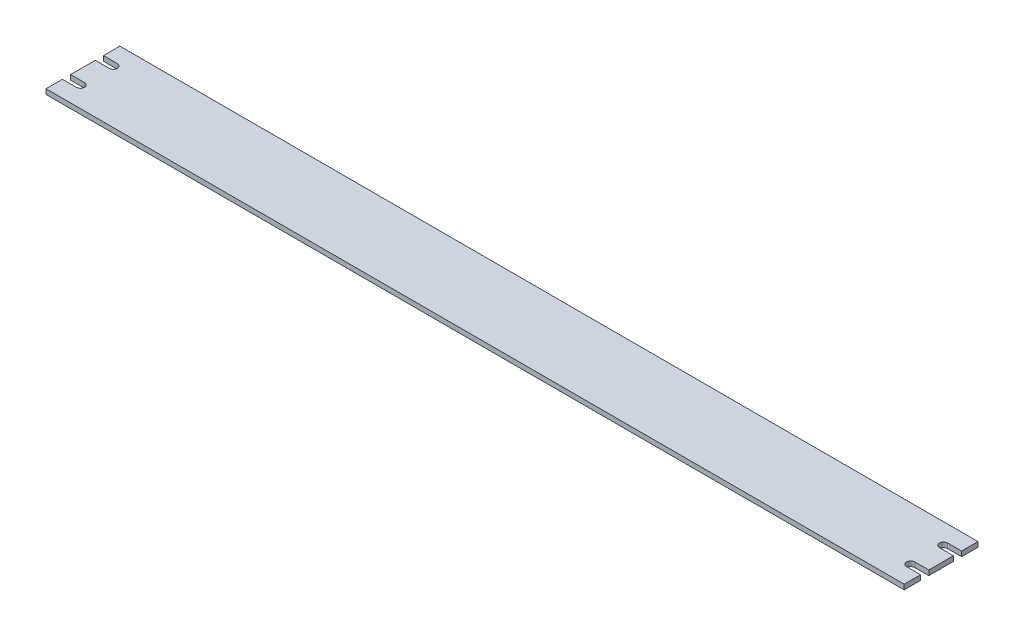
ISO-10303-21;
HEADER;
FILE_DESCRIPTION(('STEP AP214'),'2;1');
FILE_NAME('part.step','',(''),(''),'','','');
FILE_SCHEMA(('AUTOMOTIVE_DESIGN { 1 0 10303 214 1 1 1 1 }'));
ENDSEC;
DATA;
#1=APPLICATION_CONTEXT('core data for automotive mechanical design processes');
#2=APPLICATION_PROTOCOL_DEFINITION('international standard','automotive_design',2000,#1);
#3=PRODUCT_CONTEXT('',#1,'mechanical');
#4=PRODUCT('Part','Part','',(#3));
#5=PRODUCT_RELATED_PRODUCT_CATEGORY('part','',(#4));
#6=PRODUCT_DEFINITION_FORMATION('','',#4);
#7=PRODUCT_DEFINITION_CONTEXT('part definition',#1,'design');
#8=PRODUCT_DEFINITION('design','',#6,#7);
#9=PRODUCT_DEFINITION_SHAPE('','',#8);
#10=(LENGTH_UNIT() NAMED_UNIT(*) SI_UNIT(.MILLI.,.METRE.));
#11=(NAMED_UNIT(*) PLANE_ANGLE_UNIT() SI_UNIT($,.RADIAN.));
#12=(NAMED_UNIT(*) SI_UNIT($,.STERADIAN.) SOLID_ANGLE_UNIT());
#13=UNCERTAINTY_MEASURE_WITH_UNIT(LENGTH_MEASURE(1.E-05),#10,'distance_accuracy_value','');
#14=(GEOMETRIC_REPRESENTATION_CONTEXT(3) GLOBAL_UNCERTAINTY_ASSIGNED_CONTEXT((#13)) GLOBAL_UNIT_ASSIGNED_CONTEXT((#10,
#11,#12)) REPRESENTATION_CONTEXT('',''));
#15=CARTESIAN_POINT('',(0.,0.,0.));
#16=DIRECTION('',(0.,0.,1.));
#17=DIRECTION('',(1.,0.,0.));
#18=AXIS2_PLACEMENT_3D('',#15,#16,#17);
#19=CARTESIAN_POINT('',(261.5,3.,22.5));
#20=DIRECTION('',(-1.,0.,0.));
#21=DIRECTION('',(0.,0.,1.));
#22=AXIS2_PLACEMENT_3D('',#19,#20,#21);
#23=PLANE('',#22);
#24=DIRECTION('',(0.,0.,-1.));
#25=VECTOR('',#24,1.);
#26=CARTESIAN_POINT('',(261.5,0.,22.5));
#27=LINE('',#26,#25);
#28=CARTESIAN_POINT('',(261.5,0.,22.5));
#29=VERTEX_POINT('',#28);
#30=CARTESIAN_POINT('',(261.5,0.,12.5));
#31=VERTEX_POINT('',#30);
#32=EDGE_CURVE('E193',#29,#31,#27,.T.);
#33=ORIENTED_EDGE('',*,*,#32,.T.);
#34=DIRECTION('',(0.,1.,0.));
#35=VECTOR('',#34,1.);
#36=CARTESIAN_POINT('',(261.5,0.,12.5));
#37=LINE('',#36,#35);
#38=CARTESIAN_POINT('',(261.5,3.,12.5));
#39=VERTEX_POINT('',#38);
#40=EDGE_CURVE('E234',#31,#39,#37,.T.);
#41=ORIENTED_EDGE('',*,*,#40,.T.);
#42=DIRECTION('',(0.,0.,-1.));
#43=VECTOR('',#42,1.);
#44=CARTESIAN_POINT('',(261.5,3.,22.5));
#45=LINE('',#44,#43);
#46=CARTESIAN_POINT('',(261.5,3.,22.5));
#47=VERTEX_POINT('',#46);
#48=EDGE_CURVE('E217',#47,#39,#45,.T.);
#49=ORIENTED_EDGE('',*,*,#48,.F.);
#50=DIRECTION('',(0.,-1.,0.));
#51=VECTOR('',#50,1.);
#52=CARTESIAN_POINT('',(261.5,3.,22.5));
#53=LINE('',#52,#51);
#54=EDGE_CURVE('E41',#47,#29,#53,.T.);
#55=ORIENTED_EDGE('',*,*,#54,.T.);
#56=EDGE_LOOP('',(#33,#41,#49,#55));
#57=FACE_BOUND('',#56,.T.);
#58=ADVANCED_FACE('F33',(#57),#23,.F.);
#59=CARTESIAN_POINT('',(261.5,3.,7.5000000000001));
#60=VERTEX_POINT('',#59);
#61=CARTESIAN_POINT('',(261.5,3.,-7.5000000000001));
#62=VERTEX_POINT('',#61);
#63=EDGE_CURVE('E186',#60,#62,#45,.T.);
#64=ORIENTED_EDGE('',*,*,#63,.F.);
#65=DIRECTION('',(0.,1.,0.));
#66=VECTOR('',#65,1.);
#67=CARTESIAN_POINT('',(261.5,0.,7.5000000000001));
#68=LINE('',#67,#66);
#69=CARTESIAN_POINT('',(261.5,0.,7.5000000000001));
#70=VERTEX_POINT('',#69);
#71=EDGE_CURVE('E173',#70,#60,#68,.T.);
#72=ORIENTED_EDGE('',*,*,#71,.F.);
#73=CARTESIAN_POINT('',(261.5,0.,-7.5000000000001));
#74=VERTEX_POINT('',#73);
#75=EDGE_CURVE('E184',#70,#74,#27,.T.);
#76=ORIENTED_EDGE('',*,*,#75,.T.);
#77=DIRECTION('',(0.,1.,0.));
#78=VECTOR('',#77,1.);
#79=CARTESIAN_POINT('',(261.5,0.,-7.5000000000001));
#80=LINE('',#79,#78);
#81=EDGE_CURVE('E254',#74,#62,#80,.T.);
#82=ORIENTED_EDGE('',*,*,#81,.T.);
#83=EDGE_LOOP('',(#64,#72,#76,#82));
#84=FACE_BOUND('',#83,.T.);
#85=ADVANCED_FACE('F182',(#84),#23,.F.);
#86=CARTESIAN_POINT('',(-261.5,3.,22.5));
#87=DIRECTION('',(1.,0.,0.));
#88=DIRECTION('',(0.,0.,-1.));
#89=AXIS2_PLACEMENT_3D('',#86,#87,#88);
#90=PLANE('',#89);
#91=DIRECTION('',(0.,0.,1.));
#92=VECTOR('',#91,1.);
#93=CARTESIAN_POINT('',(-261.5,0.,22.5));
#94=LINE('',#93,#92);
#95=CARTESIAN_POINT('',(-261.5,0.,-7.5000000000001));
#96=VERTEX_POINT('',#95);
#97=CARTESIAN_POINT('',(-261.5,0.,7.5000000000001));
#98=VERTEX_POINT('',#97);
#99=EDGE_CURVE('E324',#96,#98,#94,.T.);
#100=ORIENTED_EDGE('',*,*,#99,.T.);
#101=DIRECTION('',(0.,1.,0.));
#102=VECTOR('',#101,1.);
#103=CARTESIAN_POINT('',(-261.5,0.,7.5000000000001));
#104=LINE('',#103,#102);
#105=CARTESIAN_POINT('',(-261.5,3.,7.5000000000001));
#106=VERTEX_POINT('',#105);
#107=EDGE_CURVE('E279',#98,#106,#104,.T.);
#108=ORIENTED_EDGE('',*,*,#107,.T.);
#109=DIRECTION('',(0.,0.,1.));
#110=VECTOR('',#109,1.);
#111=CARTESIAN_POINT('',(-261.5,3.,22.5));
#112=LINE('',#111,#110);
#113=CARTESIAN_POINT('',(-261.5,3.,-7.5000000000001));
#114=VERTEX_POINT('',#113);
#115=EDGE_CURVE('E318',#114,#106,#112,.T.);
#116=ORIENTED_EDGE('',*,*,#115,.F.);
#117=DIRECTION('',(0.,1.,0.));
#118=VECTOR('',#117,1.);
#119=CARTESIAN_POINT('',(-261.5,0.,-7.5000000000001));
#120=LINE('',#119,#118);
#121=EDGE_CURVE('E298',#96,#114,#120,.T.);
#122=ORIENTED_EDGE('',*,*,#121,.F.);
#123=EDGE_LOOP('',(#100,#108,#116,#122));
#124=FACE_BOUND('',#123,.T.);
#125=ADVANCED_FACE('F346',(#124),#90,.F.);
#126=CARTESIAN_POINT('',(-261.5,0.,-22.5));
#127=VERTEX_POINT('',#126);
#128=CARTESIAN_POINT('',(-261.5,0.,-12.5000000000001));
#129=VERTEX_POINT('',#128);
#130=EDGE_CURVE('E322',#127,#129,#94,.T.);
#131=ORIENTED_EDGE('',*,*,#130,.T.);
#132=DIRECTION('',(0.,1.,0.));
#133=VECTOR('',#132,1.);
#134=CARTESIAN_POINT('',(-261.5,0.,-12.5000000000001));
#135=LINE('',#134,#133);
#136=CARTESIAN_POINT('',(-261.5,3.,-12.5000000000001));
#137=VERTEX_POINT('',#136);
#138=EDGE_CURVE('E305',#129,#137,#135,.T.);
#139=ORIENTED_EDGE('',*,*,#138,.T.);
#140=CARTESIAN_POINT('',(-261.5,3.,-22.5));
#141=VERTEX_POINT('',#140);
#142=EDGE_CURVE('E314',#141,#137,#112,.T.);
#143=ORIENTED_EDGE('',*,*,#142,.F.);
#144=DIRECTION('',(0.,-1.,0.));
#145=VECTOR('',#144,1.);
#146=CARTESIAN_POINT('',(-261.5,3.,-22.5));
#147=LINE('',#146,#145);
#148=EDGE_CURVE('E204',#141,#127,#147,.T.);
#149=ORIENTED_EDGE('',*,*,#148,.T.);
#150=EDGE_LOOP('',(#131,#139,#143,#149));
#151=FACE_BOUND('',#150,.T.);
#152=ADVANCED_FACE('F365',(#151),#90,.F.);
#153=CARTESIAN_POINT('',(-261.5,3.,12.5));
#154=VERTEX_POINT('',#153);
#155=CARTESIAN_POINT('',(-261.5,3.,22.5));
#156=VERTEX_POINT('',#155);
#157=EDGE_CURVE('E203',#154,#156,#112,.T.);
#158=ORIENTED_EDGE('',*,*,#157,.F.);
#159=DIRECTION('',(0.,1.,0.));
#160=VECTOR('',#159,1.);
#161=CARTESIAN_POINT('',(-261.5,0.,12.5));
#162=LINE('',#161,#160);
#163=CARTESIAN_POINT('',(-261.5,0.,12.5));
#164=VERTEX_POINT('',#163);
#165=EDGE_CURVE('E272',#164,#154,#162,.T.);
#166=ORIENTED_EDGE('',*,*,#165,.F.);
#167=CARTESIAN_POINT('',(-261.5,0.,22.5));
#168=VERTEX_POINT('',#167);
#169=EDGE_CURVE('E308',#164,#168,#94,.T.);
#170=ORIENTED_EDGE('',*,*,#169,.T.);
#171=DIRECTION('',(0.,-1.,0.));
#172=VECTOR('',#171,1.);
#173=CARTESIAN_POINT('',(-261.5,3.,22.5));
#174=LINE('',#173,#172);
#175=EDGE_CURVE('E11',#156,#168,#174,.T.);
#176=ORIENTED_EDGE('',*,*,#175,.F.);
#177=EDGE_LOOP('',(#158,#166,#170,#176));
#178=FACE_BOUND('',#177,.T.);
#179=ADVANCED_FACE('F35',(#178),#90,.F.);
#180=CARTESIAN_POINT('',(261.5,3.,22.5));
#181=DIRECTION('',(0.,0.,-1.));
#182=DIRECTION('',(-1.,0.,0.));
#183=AXIS2_PLACEMENT_3D('',#180,#181,#182);
#184=PLANE('',#183);
#185=DIRECTION('',(1.,0.,0.));
#186=VECTOR('',#185,1.);
#187=CARTESIAN_POINT('',(261.5,0.,22.5));
#188=LINE('',#187,#186);
#189=EDGE_CURVE('E198',#168,#29,#188,.T.);
#190=ORIENTED_EDGE('',*,*,#189,.T.);
#191=ORIENTED_EDGE('',*,*,#54,.F.);
#192=DIRECTION('',(1.,0.,0.));
#193=VECTOR('',#192,1.);
#194=CARTESIAN_POINT('',(261.5,3.,22.5));
#195=LINE('',#194,#193);
#196=EDGE_CURVE('E317',#156,#47,#195,.T.);
#197=ORIENTED_EDGE('',*,*,#196,.F.);
#198=ORIENTED_EDGE('',*,*,#175,.T.);
#199=EDGE_LOOP('',(#190,#191,#197,#198));
#200=FACE_BOUND('',#199,.T.);
#201=ADVANCED_FACE('F400',(#200),#184,.F.);
#202=CARTESIAN_POINT('',(261.5,3.,-12.5000000000001));
#203=VERTEX_POINT('',#202);
#204=CARTESIAN_POINT('',(261.5,3.,-22.5));
#205=VERTEX_POINT('',#204);
#206=EDGE_CURVE('E320',#203,#205,#45,.T.);
#207=ORIENTED_EDGE('',*,*,#206,.F.);
#208=DIRECTION('',(0.,1.,0.));
#209=VECTOR('',#208,1.);
#210=CARTESIAN_POINT('',(261.5,0.,-12.5000000000001));
#211=LINE('',#210,#209);
#212=CARTESIAN_POINT('',(261.5,0.,-12.5000000000001));
#213=VERTEX_POINT('',#212);
#214=EDGE_CURVE('E246',#213,#203,#211,.T.);
#215=ORIENTED_EDGE('',*,*,#214,.F.);
#216=CARTESIAN_POINT('',(261.5,0.,-22.5));
#217=VERTEX_POINT('',#216);
#218=EDGE_CURVE('E194',#213,#217,#27,.T.);
#219=ORIENTED_EDGE('',*,*,#218,.T.);
#220=DIRECTION('',(0.,-1.,0.));
#221=VECTOR('',#220,1.);
#222=CARTESIAN_POINT('',(261.5,3.,-22.5));
#223=LINE('',#222,#221);
#224=EDGE_CURVE('E207',#205,#217,#223,.T.);
#225=ORIENTED_EDGE('',*,*,#224,.F.);
#226=EDGE_LOOP('',(#207,#215,#219,#225));
#227=FACE_BOUND('',#226,.T.);
#228=ADVANCED_FACE('F376',(#227),#23,.F.);
#229=CARTESIAN_POINT('',(261.5,3.,-22.5));
#230=DIRECTION('',(0.,0.,1.));
#231=DIRECTION('',(1.,0.,0.));
#232=AXIS2_PLACEMENT_3D('',#229,#230,#231);
#233=PLANE('',#232);
#234=DIRECTION('',(-1.,0.,0.));
#235=VECTOR('',#234,1.);
#236=CARTESIAN_POINT('',(261.5,0.,-22.5));
#237=LINE('',#236,#235);
#238=EDGE_CURVE('E197',#217,#127,#237,.T.);
#239=ORIENTED_EDGE('',*,*,#238,.T.);
#240=ORIENTED_EDGE('',*,*,#148,.F.);
#241=DIRECTION('',(-1.,0.,0.));
#242=VECTOR('',#241,1.);
#243=CARTESIAN_POINT('',(261.5,3.,-22.5));
#244=LINE('',#243,#242);
#245=EDGE_CURVE('E208',#205,#141,#244,.T.);
#246=ORIENTED_EDGE('',*,*,#245,.F.);
#247=ORIENTED_EDGE('',*,*,#224,.T.);
#248=EDGE_LOOP('',(#239,#240,#246,#247));
#249=FACE_BOUND('',#248,.T.);
#250=ADVANCED_FACE('F372',(#249),#233,.F.);
#251=CARTESIAN_POINT('',(0.,3.,0.));
#252=DIRECTION('',(0.,1.,0.));
#253=DIRECTION('',(0.,0.,1.));
#254=AXIS2_PLACEMENT_3D('',#251,#252,#253);
#255=PLANE('',#254);
#256=DIRECTION('',(1.,0.,0.));
#257=VECTOR('',#256,1.);
#258=CARTESIAN_POINT('',(261.5,3.,12.5));
#259=LINE('',#258,#257);
#260=CARTESIAN_POINT('',(253.,3.,12.5));
#261=VERTEX_POINT('',#260);
#262=EDGE_CURVE('E178',#261,#39,#259,.T.);
#263=ORIENTED_EDGE('',*,*,#262,.F.);
#264=CARTESIAN_POINT('',(253.,3.,9.99999999999991));
#265=DIRECTION('',(0.,1.,0.));
#266=DIRECTION('',(0.,0.,1.));
#267=AXIS2_PLACEMENT_3D('',#264,#265,#266);
#268=CIRCLE('',#267,2.49999999999994);
#269=CARTESIAN_POINT('',(253.,3.,7.49999999999997));
#270=VERTEX_POINT('',#269);
#271=EDGE_CURVE('E230',#270,#261,#268,.T.);
#272=ORIENTED_EDGE('',*,*,#271,.F.);
#273=DIRECTION('',(-1.,0.,0.));
#274=VECTOR('',#273,1.);
#275=CARTESIAN_POINT('',(261.5,3.,7.5000000000001));
#276=LINE('',#275,#274);
#277=EDGE_CURVE('E228',#60,#270,#276,.T.);
#278=ORIENTED_EDGE('',*,*,#277,.F.);
#279=ORIENTED_EDGE('',*,*,#63,.T.);
#280=DIRECTION('',(1.,0.,0.));
#281=VECTOR('',#280,1.);
#282=CARTESIAN_POINT('',(261.5,3.,-7.5000000000001));
#283=LINE('',#282,#281);
#284=CARTESIAN_POINT('',(253.,3.,-7.50000000000004));
#285=VERTEX_POINT('',#284);
#286=EDGE_CURVE('E243',#285,#62,#283,.T.);
#287=ORIENTED_EDGE('',*,*,#286,.F.);
#288=CARTESIAN_POINT('',(253.,3.,-10.));
#289=DIRECTION('',(0.,1.,0.));
#290=DIRECTION('',(0.,0.,-1.));
#291=AXIS2_PLACEMENT_3D('',#288,#289,#290);
#292=CIRCLE('',#291,2.5);
#293=CARTESIAN_POINT('',(253.,3.,-12.5000000000001));
#294=VERTEX_POINT('',#293);
#295=EDGE_CURVE('E249',#294,#285,#292,.T.);
#296=ORIENTED_EDGE('',*,*,#295,.F.);
#297=DIRECTION('',(-1.,0.,0.));
#298=VECTOR('',#297,1.);
#299=CARTESIAN_POINT('',(261.5,3.,-12.5000000000001));
#300=LINE('',#299,#298);
#301=EDGE_CURVE('E236',#203,#294,#300,.T.);
#302=ORIENTED_EDGE('',*,*,#301,.F.);
#303=ORIENTED_EDGE('',*,*,#206,.T.);
#304=ORIENTED_EDGE('',*,*,#245,.T.);
#305=ORIENTED_EDGE('',*,*,#142,.T.);
#306=DIRECTION('',(-1.,0.,0.));
#307=VECTOR('',#306,1.);
#308=CARTESIAN_POINT('',(-261.5,3.,-12.5000000000001));
#309=LINE('',#308,#307);
#310=CARTESIAN_POINT('',(-253.,3.,-12.5000000000001));
#311=VERTEX_POINT('',#310);
#312=EDGE_CURVE('E292',#311,#137,#309,.T.);
#313=ORIENTED_EDGE('',*,*,#312,.F.);
#314=CARTESIAN_POINT('',(-253.,3.,-10.));
#315=DIRECTION('',(0.,1.,0.));
#316=DIRECTION('',(0.,0.,1.));
#317=AXIS2_PLACEMENT_3D('',#314,#315,#316);
#318=CIRCLE('',#317,2.5);
#319=CARTESIAN_POINT('',(-253.,3.,-7.50000000000004));
#320=VERTEX_POINT('',#319);
#321=EDGE_CURVE('E301',#320,#311,#318,.T.);
#322=ORIENTED_EDGE('',*,*,#321,.F.);
#323=DIRECTION('',(1.,0.,0.));
#324=VECTOR('',#323,1.);
#325=CARTESIAN_POINT('',(-261.5,3.,-7.5000000000001));
#326=LINE('',#325,#324);
#327=EDGE_CURVE('E282',#114,#320,#326,.T.);
#328=ORIENTED_EDGE('',*,*,#327,.F.);
#329=ORIENTED_EDGE('',*,*,#115,.T.);
#330=DIRECTION('',(-1.,0.,0.));
#331=VECTOR('',#330,1.);
#332=CARTESIAN_POINT('',(-261.5,3.,7.5000000000001));
#333=LINE('',#332,#331);
#334=CARTESIAN_POINT('',(-253.,3.,7.5000000000001));
#335=VERTEX_POINT('',#334);
#336=EDGE_CURVE('E266',#335,#106,#333,.T.);
#337=ORIENTED_EDGE('',*,*,#336,.F.);
#338=CARTESIAN_POINT('',(-253.,3.,10.));
#339=DIRECTION('',(0.,1.,0.));
#340=DIRECTION('',(0.,0.,-1.));
#341=AXIS2_PLACEMENT_3D('',#338,#339,#340);
#342=CIRCLE('',#341,2.49999999999994);
#343=CARTESIAN_POINT('',(-253.,3.,12.5));
#344=VERTEX_POINT('',#343);
#345=EDGE_CURVE('E275',#344,#335,#342,.T.);
#346=ORIENTED_EDGE('',*,*,#345,.F.);
#347=DIRECTION('',(1.,0.,0.));
#348=VECTOR('',#347,1.);
#349=CARTESIAN_POINT('',(-261.5,3.,12.5));
#350=LINE('',#349,#348);
#351=EDGE_CURVE('E256',#154,#344,#350,.T.);
#352=ORIENTED_EDGE('',*,*,#351,.F.);
#353=ORIENTED_EDGE('',*,*,#157,.T.);
#354=ORIENTED_EDGE('',*,*,#196,.T.);
#355=ORIENTED_EDGE('',*,*,#48,.T.);
#356=EDGE_LOOP('',(#263,#272,#278,#279,#287,#296,#302,#303,#304,#305,#313,#322,#328,#329,#337,
#346,#352,#353,#354,#355));
#357=FACE_BOUND('',#356,.T.);
#358=ADVANCED_FACE('F356',(#357),#255,.T.);
#359=CARTESIAN_POINT('',(0.,0.,0.));
#360=DIRECTION('',(0.,1.,0.));
#361=DIRECTION('',(0.,0.,1.));
#362=AXIS2_PLACEMENT_3D('',#359,#360,#361);
#363=PLANE('',#362);
#364=CARTESIAN_POINT('',(253.,0.,9.99999999999991));
#365=DIRECTION('',(0.,1.,0.));
#366=DIRECTION('',(0.,0.,1.));
#367=AXIS2_PLACEMENT_3D('',#364,#365,#366);
#368=CIRCLE('',#367,2.49999999999994);
#369=CARTESIAN_POINT('',(253.,0.,7.5000000000001));
#370=VERTEX_POINT('',#369);
#371=CARTESIAN_POINT('',(253.,0.,12.5));
#372=VERTEX_POINT('',#371);
#373=EDGE_CURVE('E48',#370,#372,#368,.T.);
#374=ORIENTED_EDGE('',*,*,#373,.T.);
#375=DIRECTION('',(1.,0.,0.));
#376=VECTOR('',#375,1.);
#377=CARTESIAN_POINT('',(261.5,0.,12.5));
#378=LINE('',#377,#376);
#379=EDGE_CURVE('E187',#372,#31,#378,.T.);
#380=ORIENTED_EDGE('',*,*,#379,.T.);
#381=ORIENTED_EDGE('',*,*,#32,.F.);
#382=ORIENTED_EDGE('',*,*,#189,.F.);
#383=ORIENTED_EDGE('',*,*,#169,.F.);
#384=DIRECTION('',(1.,0.,0.));
#385=VECTOR('',#384,1.);
#386=CARTESIAN_POINT('',(-261.5,0.,12.5));
#387=LINE('',#386,#385);
#388=CARTESIAN_POINT('',(-253.,0.,12.5));
#389=VERTEX_POINT('',#388);
#390=EDGE_CURVE('E262',#164,#389,#387,.T.);
#391=ORIENTED_EDGE('',*,*,#390,.T.);
#392=CARTESIAN_POINT('',(-253.,0.,10.));
#393=DIRECTION('',(0.,1.,0.));
#394=DIRECTION('',(0.,0.,-1.));
#395=AXIS2_PLACEMENT_3D('',#392,#393,#394);
#396=CIRCLE('',#395,2.49999999999994);
#397=CARTESIAN_POINT('',(-253.,0.,7.5000000000001));
#398=VERTEX_POINT('',#397);
#399=EDGE_CURVE('E265',#389,#398,#396,.T.);
#400=ORIENTED_EDGE('',*,*,#399,.T.);
#401=DIRECTION('',(-1.,0.,0.));
#402=VECTOR('',#401,1.);
#403=CARTESIAN_POINT('',(-261.5,0.,7.5000000000001));
#404=LINE('',#403,#402);
#405=EDGE_CURVE('E269',#398,#98,#404,.T.);
#406=ORIENTED_EDGE('',*,*,#405,.T.);
#407=ORIENTED_EDGE('',*,*,#99,.F.);
#408=DIRECTION('',(1.,0.,0.));
#409=VECTOR('',#408,1.);
#410=CARTESIAN_POINT('',(-261.5,0.,-7.5000000000001));
#411=LINE('',#410,#409);
#412=CARTESIAN_POINT('',(-253.,0.,-7.5000000000001));
#413=VERTEX_POINT('',#412);
#414=EDGE_CURVE('E288',#96,#413,#411,.T.);
#415=ORIENTED_EDGE('',*,*,#414,.T.);
#416=CARTESIAN_POINT('',(-253.,0.,-10.));
#417=DIRECTION('',(0.,1.,0.));
#418=DIRECTION('',(0.,0.,1.));
#419=AXIS2_PLACEMENT_3D('',#416,#417,#418);
#420=CIRCLE('',#419,2.5);
#421=CARTESIAN_POINT('',(-253.,0.,-12.5000000000001));
#422=VERTEX_POINT('',#421);
#423=EDGE_CURVE('E291',#413,#422,#420,.T.);
#424=ORIENTED_EDGE('',*,*,#423,.T.);
#425=DIRECTION('',(-1.,0.,0.));
#426=VECTOR('',#425,1.);
#427=CARTESIAN_POINT('',(-261.5,0.,-12.5000000000001));
#428=LINE('',#427,#426);
#429=EDGE_CURVE('E295',#422,#129,#428,.T.);
#430=ORIENTED_EDGE('',*,*,#429,.T.);
#431=ORIENTED_EDGE('',*,*,#130,.F.);
#432=ORIENTED_EDGE('',*,*,#238,.F.);
#433=ORIENTED_EDGE('',*,*,#218,.F.);
#434=DIRECTION('',(-1.,0.,0.));
#435=VECTOR('',#434,1.);
#436=CARTESIAN_POINT('',(261.5,0.,-12.5000000000001));
#437=LINE('',#436,#435);
#438=CARTESIAN_POINT('',(253.,0.,-12.5000000000001));
#439=VERTEX_POINT('',#438);
#440=EDGE_CURVE('E240',#213,#439,#437,.T.);
#441=ORIENTED_EDGE('',*,*,#440,.T.);
#442=CARTESIAN_POINT('',(253.,0.,-10.));
#443=DIRECTION('',(0.,1.,0.));
#444=DIRECTION('',(0.,0.,-1.));
#445=AXIS2_PLACEMENT_3D('',#442,#443,#444);
#446=CIRCLE('',#445,2.5);
#447=CARTESIAN_POINT('',(253.,0.,-7.50000000000004));
#448=VERTEX_POINT('',#447);
#449=EDGE_CURVE('E56',#439,#448,#446,.T.);
#450=ORIENTED_EDGE('',*,*,#449,.T.);
#451=DIRECTION('',(1.,0.,0.));
#452=VECTOR('',#451,1.);
#453=CARTESIAN_POINT('',(261.5,0.,-7.5000000000001));
#454=LINE('',#453,#452);
#455=EDGE_CURVE('E192',#448,#74,#454,.T.);
#456=ORIENTED_EDGE('',*,*,#455,.T.);
#457=ORIENTED_EDGE('',*,*,#75,.F.);
#458=DIRECTION('',(-1.,0.,0.));
#459=VECTOR('',#458,1.);
#460=CARTESIAN_POINT('',(261.5,0.,7.5000000000001));
#461=LINE('',#460,#459);
#462=EDGE_CURVE('E169',#70,#370,#461,.T.);
#463=ORIENTED_EDGE('',*,*,#462,.T.);
#464=EDGE_LOOP('',(#374,#380,#381,#382,#383,#391,#400,#406,#407,#415,#424,#430,#431,#432,#433,
#441,#450,#456,#457,#463));
#465=FACE_BOUND('',#464,.T.);
#466=ADVANCED_FACE('F190',(#465),#363,.F.);
#467=CARTESIAN_POINT('',(-261.5,0.,-12.5000000000001));
#468=DIRECTION('',(0.,0.,-1.));
#469=DIRECTION('',(-1.,0.,0.));
#470=AXIS2_PLACEMENT_3D('',#467,#468,#469);
#471=PLANE('',#470);
#472=ORIENTED_EDGE('',*,*,#312,.T.);
#473=ORIENTED_EDGE('',*,*,#138,.F.);
#474=ORIENTED_EDGE('',*,*,#429,.F.);
#475=DIRECTION('',(0.,1.,0.));
#476=VECTOR('',#475,1.);
#477=CARTESIAN_POINT('',(-253.,0.,-12.5000000000001));
#478=LINE('',#477,#476);
#479=EDGE_CURVE('E309',#422,#311,#478,.T.);
#480=ORIENTED_EDGE('',*,*,#479,.T.);
#481=EDGE_LOOP('',(#472,#473,#474,#480));
#482=FACE_BOUND('',#481,.T.);
#483=ADVANCED_FACE('F363',(#482),#471,.F.);
#484=CARTESIAN_POINT('',(-253.,0.,-10.));
#485=DIRECTION('',(0.,1.,0.));
#486=DIRECTION('',(0.,0.,1.));
#487=AXIS2_PLACEMENT_3D('',#484,#485,#486);
#488=CYLINDRICAL_SURFACE('',#487,2.5);
#489=ORIENTED_EDGE('',*,*,#321,.T.);
#490=ORIENTED_EDGE('',*,*,#479,.F.);
#491=ORIENTED_EDGE('',*,*,#423,.F.);
#492=DIRECTION('',(0.,1.,0.));
#493=VECTOR('',#492,1.);
#494=CARTESIAN_POINT('',(-253.,0.,-7.50000000000004));
#495=LINE('',#494,#493);
#496=EDGE_CURVE('E311',#413,#320,#495,.T.);
#497=ORIENTED_EDGE('',*,*,#496,.T.);
#498=EDGE_LOOP('',(#489,#490,#491,#497));
#499=FACE_BOUND('',#498,.T.);
#500=ADVANCED_FACE('F359',(#499),#488,.F.);
#501=CARTESIAN_POINT('',(-261.5,0.,-7.5000000000001));
#502=DIRECTION('',(0.,0.,1.));
#503=DIRECTION('',(1.,0.,0.));
#504=AXIS2_PLACEMENT_3D('',#501,#502,#503);
#505=PLANE('',#504);
#506=ORIENTED_EDGE('',*,*,#327,.T.);
#507=ORIENTED_EDGE('',*,*,#496,.F.);
#508=ORIENTED_EDGE('',*,*,#414,.F.);
#509=ORIENTED_EDGE('',*,*,#121,.T.);
#510=EDGE_LOOP('',(#506,#507,#508,#509));
#511=FACE_BOUND('',#510,.T.);
#512=ADVANCED_FACE('F351',(#511),#505,.F.);
#513=CARTESIAN_POINT('',(-261.5,0.,7.5000000000001));
#514=DIRECTION('',(0.,0.,-1.));
#515=DIRECTION('',(-1.,0.,0.));
#516=AXIS2_PLACEMENT_3D('',#513,#514,#515);
#517=PLANE('',#516);
#518=ORIENTED_EDGE('',*,*,#336,.T.);
#519=ORIENTED_EDGE('',*,*,#107,.F.);
#520=ORIENTED_EDGE('',*,*,#405,.F.);
#521=DIRECTION('',(0.,1.,0.));
#522=VECTOR('',#521,1.);
#523=CARTESIAN_POINT('',(-253.,0.,7.5000000000001));
#524=LINE('',#523,#522);
#525=EDGE_CURVE('E283',#398,#335,#524,.T.);
#526=ORIENTED_EDGE('',*,*,#525,.T.);
#527=EDGE_LOOP('',(#518,#519,#520,#526));
#528=FACE_BOUND('',#527,.T.);
#529=ADVANCED_FACE('F342',(#528),#517,.F.);
#530=CARTESIAN_POINT('',(-253.,0.,10.));
#531=DIRECTION('',(0.,1.,0.));
#532=DIRECTION('',(0.,0.,1.));
#533=AXIS2_PLACEMENT_3D('',#530,#531,#532);
#534=CYLINDRICAL_SURFACE('',#533,2.49999999999994);
#535=ORIENTED_EDGE('',*,*,#345,.T.);
#536=ORIENTED_EDGE('',*,*,#525,.F.);
#537=ORIENTED_EDGE('',*,*,#399,.F.);
#538=DIRECTION('',(0.,1.,0.));
#539=VECTOR('',#538,1.);
#540=CARTESIAN_POINT('',(-253.,0.,12.5));
#541=LINE('',#540,#539);
#542=EDGE_CURVE('E285',#389,#344,#541,.T.);
#543=ORIENTED_EDGE('',*,*,#542,.T.);
#544=EDGE_LOOP('',(#535,#536,#537,#543));
#545=FACE_BOUND('',#544,.T.);
#546=ADVANCED_FACE('F338',(#545),#534,.F.);
#547=CARTESIAN_POINT('',(-261.5,0.,12.5));
#548=DIRECTION('',(0.,0.,1.));
#549=DIRECTION('',(1.,0.,0.));
#550=AXIS2_PLACEMENT_3D('',#547,#548,#549);
#551=PLANE('',#550);
#552=ORIENTED_EDGE('',*,*,#351,.T.);
#553=ORIENTED_EDGE('',*,*,#542,.F.);
#554=ORIENTED_EDGE('',*,*,#390,.F.);
#555=ORIENTED_EDGE('',*,*,#165,.T.);
#556=EDGE_LOOP('',(#552,#553,#554,#555));
#557=FACE_BOUND('',#556,.T.);
#558=ADVANCED_FACE('F334',(#557),#551,.F.);
#559=CARTESIAN_POINT('',(261.5,0.,-7.5000000000001));
#560=DIRECTION('',(0.,0.,1.));
#561=DIRECTION('',(1.,0.,0.));
#562=AXIS2_PLACEMENT_3D('',#559,#560,#561);
#563=PLANE('',#562);
#564=ORIENTED_EDGE('',*,*,#286,.T.);
#565=ORIENTED_EDGE('',*,*,#81,.F.);
#566=ORIENTED_EDGE('',*,*,#455,.F.);
#567=DIRECTION('',(0.,1.,0.));
#568=VECTOR('',#567,1.);
#569=CARTESIAN_POINT('',(253.,0.,-7.50000000000004));
#570=LINE('',#569,#568);
#571=EDGE_CURVE('E257',#448,#285,#570,.T.);
#572=ORIENTED_EDGE('',*,*,#571,.T.);
#573=EDGE_LOOP('',(#564,#565,#566,#572));
#574=FACE_BOUND('',#573,.T.);
#575=ADVANCED_FACE('F383',(#574),#563,.F.);
#576=CARTESIAN_POINT('',(253.,0.,-10.));
#577=DIRECTION('',(0.,1.,0.));
#578=DIRECTION('',(0.,0.,1.));
#579=AXIS2_PLACEMENT_3D('',#576,#577,#578);
#580=CYLINDRICAL_SURFACE('',#579,2.5);
#581=ORIENTED_EDGE('',*,*,#295,.T.);
#582=ORIENTED_EDGE('',*,*,#571,.F.);
#583=ORIENTED_EDGE('',*,*,#449,.F.);
#584=DIRECTION('',(0.,1.,0.));
#585=VECTOR('',#584,1.);
#586=CARTESIAN_POINT('',(253.,0.,-12.5000000000001));
#587=LINE('',#586,#585);
#588=EDGE_CURVE('E259',#439,#294,#587,.T.);
#589=ORIENTED_EDGE('',*,*,#588,.T.);
#590=EDGE_LOOP('',(#581,#582,#583,#589));
#591=FACE_BOUND('',#590,.T.);
#592=ADVANCED_FACE('F381',(#591),#580,.F.);
#593=CARTESIAN_POINT('',(261.5,0.,-12.5000000000001));
#594=DIRECTION('',(0.,0.,-1.));
#595=DIRECTION('',(-1.,0.,0.));
#596=AXIS2_PLACEMENT_3D('',#593,#594,#595);
#597=PLANE('',#596);
#598=ORIENTED_EDGE('',*,*,#301,.T.);
#599=ORIENTED_EDGE('',*,*,#588,.F.);
#600=ORIENTED_EDGE('',*,*,#440,.F.);
#601=ORIENTED_EDGE('',*,*,#214,.T.);
#602=EDGE_LOOP('',(#598,#599,#600,#601));
#603=FACE_BOUND('',#602,.T.);
#604=ADVANCED_FACE('F378',(#603),#597,.F.);
#605=CARTESIAN_POINT('',(261.5,0.,12.5));
#606=DIRECTION('',(0.,0.,1.));
#607=DIRECTION('',(1.,0.,0.));
#608=AXIS2_PLACEMENT_3D('',#605,#606,#607);
#609=PLANE('',#608);
#610=ORIENTED_EDGE('',*,*,#262,.T.);
#611=ORIENTED_EDGE('',*,*,#40,.F.);
#612=ORIENTED_EDGE('',*,*,#379,.F.);
#613=DIRECTION('',(0.,1.,0.));
#614=VECTOR('',#613,1.);
#615=CARTESIAN_POINT('',(253.,0.,12.5));
#616=LINE('',#615,#614);
#617=EDGE_CURVE('E237',#372,#261,#616,.T.);
#618=ORIENTED_EDGE('',*,*,#617,.T.);
#619=EDGE_LOOP('',(#610,#611,#612,#618));
#620=FACE_BOUND('',#619,.T.);
#621=ADVANCED_FACE('F409',(#620),#609,.F.);
#622=CARTESIAN_POINT('',(253.,0.,9.99999999999991));
#623=DIRECTION('',(0.,1.,0.));
#624=DIRECTION('',(0.,0.,1.));
#625=AXIS2_PLACEMENT_3D('',#622,#623,#624);
#626=CYLINDRICAL_SURFACE('',#625,2.49999999999994);
#627=ORIENTED_EDGE('',*,*,#271,.T.);
#628=ORIENTED_EDGE('',*,*,#617,.F.);
#629=ORIENTED_EDGE('',*,*,#373,.F.);
#630=DIRECTION('',(0.,1.,0.));
#631=VECTOR('',#630,1.);
#632=CARTESIAN_POINT('',(253.,0.,7.49999999999997));
#633=LINE('',#632,#631);
#634=EDGE_CURVE('E175',#370,#270,#633,.T.);
#635=ORIENTED_EDGE('',*,*,#634,.T.);
#636=EDGE_LOOP('',(#627,#628,#629,#635));
#637=FACE_BOUND('',#636,.T.);
#638=ADVANCED_FACE('F410',(#637),#626,.F.);
#639=CARTESIAN_POINT('',(261.5,0.,7.5000000000001));
#640=DIRECTION('',(0.,0.,-1.));
#641=DIRECTION('',(-1.,0.,0.));
#642=AXIS2_PLACEMENT_3D('',#639,#640,#641);
#643=PLANE('',#642);
#644=ORIENTED_EDGE('',*,*,#277,.T.);
#645=ORIENTED_EDGE('',*,*,#634,.F.);
#646=ORIENTED_EDGE('',*,*,#462,.F.);
#647=ORIENTED_EDGE('',*,*,#71,.T.);
#648=EDGE_LOOP('',(#644,#645,#646,#647));
#649=FACE_BOUND('',#648,.T.);
#650=ADVANCED_FACE('F172',(#649),#643,.F.);
#651=CLOSED_SHELL('',(#58,#85,#125,#152,#179,#201,#228,#250,#358,#466,#483,#500,#512,#529,#546,
#558,#575,#592,#604,#621,#638,#650));
#652=MANIFOLD_SOLID_BREP('B2',#651);
#653=ADVANCED_BREP_SHAPE_REPRESENTATION('',(#18,#652),#14);
#654=SHAPE_DEFINITION_REPRESENTATION(#9,#653);
ENDSEC;
END-ISO-10303-21;
